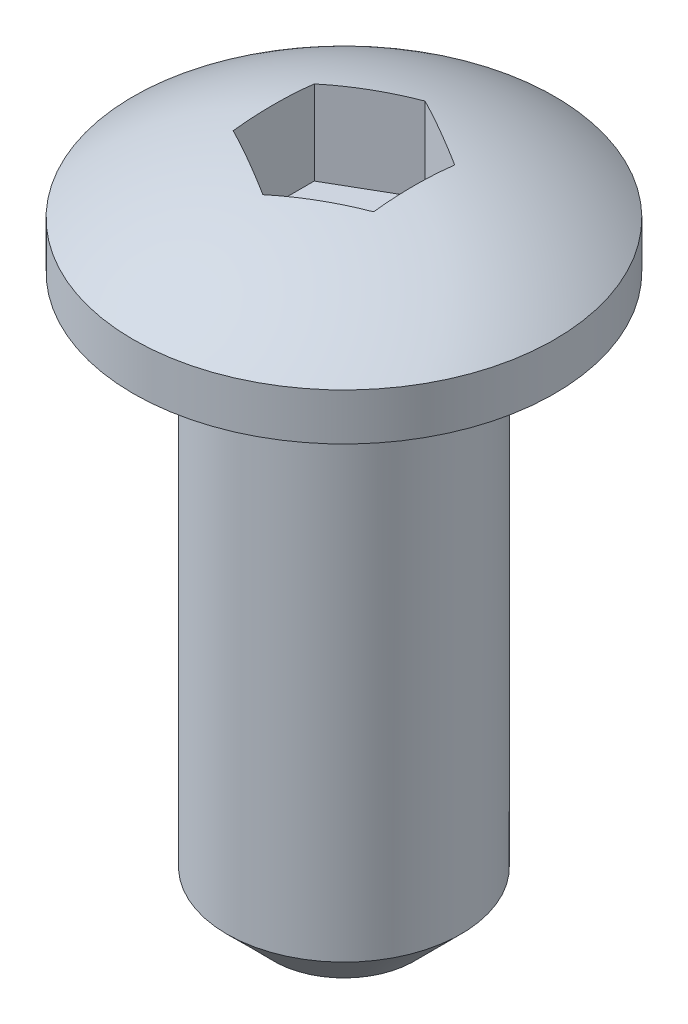
ISO-10303-21;
HEADER;
FILE_DESCRIPTION(('STEP AP214'),'2;1');
FILE_NAME('part.step','',(''),(''),'','','');
FILE_SCHEMA(('AUTOMOTIVE_DESIGN { 1 0 10303 214 1 1 1 1 }'));
ENDSEC;
DATA;
#1=APPLICATION_CONTEXT('core data for automotive mechanical design processes');
#2=APPLICATION_PROTOCOL_DEFINITION('international standard','automotive_design',2000,#1);
#3=PRODUCT_CONTEXT('',#1,'mechanical');
#4=PRODUCT('Part','Part','',(#3));
#5=PRODUCT_RELATED_PRODUCT_CATEGORY('part','',(#4));
#6=PRODUCT_DEFINITION_FORMATION('','',#4);
#7=PRODUCT_DEFINITION_CONTEXT('part definition',#1,'design');
#8=PRODUCT_DEFINITION('design','',#6,#7);
#9=PRODUCT_DEFINITION_SHAPE('','',#8);
#10=(LENGTH_UNIT() NAMED_UNIT(*) SI_UNIT(.MILLI.,.METRE.));
#11=(NAMED_UNIT(*) PLANE_ANGLE_UNIT() SI_UNIT($,.RADIAN.));
#12=(NAMED_UNIT(*) SI_UNIT($,.STERADIAN.) SOLID_ANGLE_UNIT());
#13=UNCERTAINTY_MEASURE_WITH_UNIT(LENGTH_MEASURE(1.E-05),#10,'distance_accuracy_value','');
#14=(GEOMETRIC_REPRESENTATION_CONTEXT(3) GLOBAL_UNCERTAINTY_ASSIGNED_CONTEXT((#13)) GLOBAL_UNIT_ASSIGNED_CONTEXT((#10,
#11,#12)) REPRESENTATION_CONTEXT('',''));
#15=CARTESIAN_POINT('',(0.,0.,0.));
#16=DIRECTION('',(0.,0.,1.));
#17=DIRECTION('',(1.,0.,0.));
#18=AXIS2_PLACEMENT_3D('',#15,#16,#17);
#19=CARTESIAN_POINT('',(0.,-5.,0.));
#20=DIRECTION('',(0.,1.,0.));
#21=DIRECTION('',(-1.,0.,0.));
#22=AXIS2_PLACEMENT_3D('',#19,#20,#21);
#23=SPHERICAL_SURFACE('',#22,7.5);
#24=CARTESIAN_POINT('',(0.,1.,0.));
#25=DIRECTION('',(0.,1.,0.));
#26=DIRECTION('',(0.,0.,1.));
#27=AXIS2_PLACEMENT_3D('',#24,#25,#26);
#28=CIRCLE('',#27,4.5);
#29=CARTESIAN_POINT('',(0.,1.,4.5));
#30=VERTEX_POINT('',#29);
#31=EDGE_CURVE('E123',#30,#30,#28,.T.);
#32=ORIENTED_EDGE('',*,*,#31,.T.);
#33=EDGE_LOOP('',(#32));
#34=FACE_BOUND('',#33,.T.);
#35=CARTESIAN_POINT('',(-0.749999999999999,-5.,-1.29903810567666));
#36=DIRECTION('',(0.5,0.,0.866025403784439));
#37=DIRECTION('',(0.866025403784439,0.,-0.5));
#38=AXIS2_PLACEMENT_3D('',#35,#36,#37);
#39=CIRCLE('',#38,7.34846922834954);
#40=CARTESIAN_POINT('',(-1.5,2.29725975966321,-0.866025403784439));
#41=VERTEX_POINT('',#40);
#42=CARTESIAN_POINT('',(0.,2.29725975966321,-1.73205080756888));
#43=VERTEX_POINT('',#42);
#44=EDGE_CURVE('E138',#41,#43,#39,.F.);
#45=ORIENTED_EDGE('',*,*,#44,.T.);
#46=CARTESIAN_POINT('',(0.750000000000002,-5.,-1.29903810567666));
#47=DIRECTION('',(-0.5,0.,0.866025403784438));
#48=DIRECTION('',(0.866025403784439,0.,0.5));
#49=AXIS2_PLACEMENT_3D('',#46,#47,#48);
#50=CIRCLE('',#49,7.34846922834954);
#51=CARTESIAN_POINT('',(1.5,2.29725975966321,-0.866025403784439));
#52=VERTEX_POINT('',#51);
#53=EDGE_CURVE('E49',#43,#52,#50,.F.);
#54=ORIENTED_EDGE('',*,*,#53,.T.);
#55=CARTESIAN_POINT('',(1.5,-5.,0.));
#56=DIRECTION('',(-1.,0.,0.));
#57=DIRECTION('',(0.,0.,1.));
#58=AXIS2_PLACEMENT_3D('',#55,#56,#57);
#59=CIRCLE('',#58,7.34846922834954);
#60=CARTESIAN_POINT('',(1.5,2.29725975966321,0.86602540378444));
#61=VERTEX_POINT('',#60);
#62=EDGE_CURVE('E126',#52,#61,#59,.F.);
#63=ORIENTED_EDGE('',*,*,#62,.T.);
#64=CARTESIAN_POINT('',(0.750000000000002,-5.,1.29903810567666));
#65=DIRECTION('',(-0.5,0.,-0.866025403784439));
#66=DIRECTION('',(-0.866025403784439,0.,0.5));
#67=AXIS2_PLACEMENT_3D('',#64,#65,#66);
#68=CIRCLE('',#67,7.34846922834954);
#69=CARTESIAN_POINT('',(0.,2.29725975966321,1.73205080756888));
#70=VERTEX_POINT('',#69);
#71=EDGE_CURVE('E129',#61,#70,#68,.F.);
#72=ORIENTED_EDGE('',*,*,#71,.T.);
#73=CARTESIAN_POINT('',(-0.749999999999998,-5.,1.29903810567666));
#74=DIRECTION('',(0.5,0.,-0.866025403784439));
#75=DIRECTION('',(-0.866025403784439,0.,-0.5));
#76=AXIS2_PLACEMENT_3D('',#73,#74,#75);
#77=CIRCLE('',#76,7.34846922834954);
#78=CARTESIAN_POINT('',(-1.5,2.29725975966321,0.866025403784438));
#79=VERTEX_POINT('',#78);
#80=EDGE_CURVE('E132',#70,#79,#77,.F.);
#81=ORIENTED_EDGE('',*,*,#80,.T.);
#82=CARTESIAN_POINT('',(-1.5,-5.,0.));
#83=DIRECTION('',(1.,0.,0.));
#84=DIRECTION('',(0.,0.,-1.));
#85=AXIS2_PLACEMENT_3D('',#82,#83,#84);
#86=CIRCLE('',#85,7.34846922834954);
#87=EDGE_CURVE('E135',#79,#41,#86,.F.);
#88=ORIENTED_EDGE('',*,*,#87,.T.);
#89=EDGE_LOOP('',(#45,#54,#63,#72,#81,#88));
#90=FACE_BOUND('',#89,.T.);
#91=ADVANCED_FACE('F26',(#34,#90),#23,.T.);
#92=CARTESIAN_POINT('',(0.,-12.,0.));
#93=DIRECTION('',(0.,-1.,0.));
#94=DIRECTION('',(0.,0.,-1.));
#95=AXIS2_PLACEMENT_3D('',#92,#93,#94);
#96=PLANE('',#95);
#97=CARTESIAN_POINT('',(0.,-12.,0.));
#98=DIRECTION('',(0.,-1.,0.));
#99=DIRECTION('',(0.,0.,-1.));
#100=AXIS2_PLACEMENT_3D('',#97,#98,#99);
#101=CIRCLE('',#100,1.49999999999999);
#102=CARTESIAN_POINT('',(0.,-12.,-1.49999999999999));
#103=VERTEX_POINT('',#102);
#104=EDGE_CURVE('E11',#103,#103,#101,.T.);
#105=ORIENTED_EDGE('',*,*,#104,.T.);
#106=EDGE_LOOP('',(#105));
#107=FACE_BOUND('',#106,.T.);
#108=ADVANCED_FACE('F28',(#107),#96,.T.);
#109=CARTESIAN_POINT('',(0.,16.1829805996473,0.));
#110=DIRECTION('',(0.,1.,0.));
#111=DIRECTION('',(0.,0.,1.));
#112=AXIS2_PLACEMENT_3D('',#109,#110,#111);
#113=CYLINDRICAL_SURFACE('',#112,4.5);
#114=CARTESIAN_POINT('',(0.,0.,0.));
#115=DIRECTION('',(0.,1.,0.));
#116=DIRECTION('',(0.,0.,1.));
#117=AXIS2_PLACEMENT_3D('',#114,#115,#116);
#118=CIRCLE('',#117,4.5);
#119=CARTESIAN_POINT('',(0.,0.,4.5));
#120=VERTEX_POINT('',#119);
#121=EDGE_CURVE('E120',#120,#120,#118,.T.);
#122=ORIENTED_EDGE('',*,*,#121,.T.);
#123=EDGE_LOOP('',(#122));
#124=FACE_BOUND('',#123,.T.);
#125=ORIENTED_EDGE('',*,*,#31,.F.);
#126=EDGE_LOOP('',(#125));
#127=FACE_BOUND('',#126,.T.);
#128=ADVANCED_FACE('F164',(#124,#127),#113,.T.);
#129=CARTESIAN_POINT('',(-2.5,0.,0.));
#130=DIRECTION('',(0.,-1.,0.));
#131=DIRECTION('',(0.,0.,-1.));
#132=AXIS2_PLACEMENT_3D('',#129,#130,#131);
#133=PLANE('',#132);
#134=CARTESIAN_POINT('',(0.,0.,0.));
#135=DIRECTION('',(0.,1.,0.));
#136=DIRECTION('',(0.,0.,1.));
#137=AXIS2_PLACEMENT_3D('',#134,#135,#136);
#138=CIRCLE('',#137,2.5);
#139=CARTESIAN_POINT('',(0.,0.,2.5));
#140=VERTEX_POINT('',#139);
#141=EDGE_CURVE('E85',#140,#140,#138,.T.);
#142=ORIENTED_EDGE('',*,*,#141,.T.);
#143=EDGE_LOOP('',(#142));
#144=FACE_BOUND('',#143,.T.);
#145=ORIENTED_EDGE('',*,*,#121,.F.);
#146=EDGE_LOOP('',(#145));
#147=FACE_BOUND('',#146,.T.);
#148=ADVANCED_FACE('F170',(#144,#147),#133,.T.);
#149=CARTESIAN_POINT('',(0.,16.1829805996473,0.));
#150=DIRECTION('',(0.,1.,0.));
#151=DIRECTION('',(0.,0.,1.));
#152=AXIS2_PLACEMENT_3D('',#149,#150,#151);
#153=CYLINDRICAL_SURFACE('',#152,2.5);
#154=CARTESIAN_POINT('',(0.,-11.,0.));
#155=DIRECTION('',(0.,-1.,0.));
#156=DIRECTION('',(0.,0.,-1.));
#157=AXIS2_PLACEMENT_3D('',#154,#155,#156);
#158=CIRCLE('',#157,2.5);
#159=CARTESIAN_POINT('',(0.,-11.,-2.5));
#160=VERTEX_POINT('',#159);
#161=EDGE_CURVE('E34',#160,#160,#158,.F.);
#162=ORIENTED_EDGE('',*,*,#161,.T.);
#163=EDGE_LOOP('',(#162));
#164=FACE_BOUND('',#163,.T.);
#165=ORIENTED_EDGE('',*,*,#141,.F.);
#166=EDGE_LOOP('',(#165));
#167=FACE_BOUND('',#166,.T.);
#168=ADVANCED_FACE('F143',(#164,#167),#153,.T.);
#169=CARTESIAN_POINT('',(1.5,2.5,-0.866025403784439));
#170=DIRECTION('',(-0.5,0.,0.866025403784438));
#171=DIRECTION('',(0.866025403784439,0.,0.5));
#172=AXIS2_PLACEMENT_3D('',#169,#170,#171);
#173=PLANE('',#172);
#174=DIRECTION('',(0.,-1.,0.));
#175=VECTOR('',#174,1.);
#176=CARTESIAN_POINT('',(0.,2.5,-1.73205080756888));
#177=LINE('',#176,#175);
#178=CARTESIAN_POINT('',(0.,0.5,-1.73205080756888));
#179=VERTEX_POINT('',#178);
#180=EDGE_CURVE('E78',#43,#179,#177,.T.);
#181=ORIENTED_EDGE('',*,*,#180,.T.);
#182=DIRECTION('',(-0.866025403784439,0.,-0.5));
#183=VECTOR('',#182,1.);
#184=CARTESIAN_POINT('',(1.5,0.5,-0.866025403784439));
#185=LINE('',#184,#183);
#186=CARTESIAN_POINT('',(1.5,0.5,-0.866025403784439));
#187=VERTEX_POINT('',#186);
#188=EDGE_CURVE('E82',#187,#179,#185,.T.);
#189=ORIENTED_EDGE('',*,*,#188,.F.);
#190=DIRECTION('',(0.,-1.,0.));
#191=VECTOR('',#190,1.);
#192=CARTESIAN_POINT('',(1.5,2.5,-0.866025403784439));
#193=LINE('',#192,#191);
#194=EDGE_CURVE('E110',#52,#187,#193,.T.);
#195=ORIENTED_EDGE('',*,*,#194,.F.);
#196=ORIENTED_EDGE('',*,*,#53,.F.);
#197=EDGE_LOOP('',(#181,#189,#195,#196));
#198=FACE_BOUND('',#197,.T.);
#199=ADVANCED_FACE('F80',(#198),#173,.T.);
#200=CARTESIAN_POINT('',(0.,2.5,-1.73205080756888));
#201=DIRECTION('',(0.5,0.,0.866025403784439));
#202=DIRECTION('',(0.866025403784439,0.,-0.5));
#203=AXIS2_PLACEMENT_3D('',#200,#201,#202);
#204=PLANE('',#203);
#205=DIRECTION('',(0.,-1.,0.));
#206=VECTOR('',#205,1.);
#207=CARTESIAN_POINT('',(-1.5,2.5,-0.866025403784439));
#208=LINE('',#207,#206);
#209=CARTESIAN_POINT('',(-1.5,0.5,-0.866025403784439));
#210=VERTEX_POINT('',#209);
#211=EDGE_CURVE('E86',#41,#210,#208,.T.);
#212=ORIENTED_EDGE('',*,*,#211,.T.);
#213=DIRECTION('',(-0.866025403784439,0.,0.5));
#214=VECTOR('',#213,1.);
#215=CARTESIAN_POINT('',(0.,0.5,-1.73205080756888));
#216=LINE('',#215,#214);
#217=EDGE_CURVE('E89',#179,#210,#216,.T.);
#218=ORIENTED_EDGE('',*,*,#217,.F.);
#219=ORIENTED_EDGE('',*,*,#180,.F.);
#220=ORIENTED_EDGE('',*,*,#44,.F.);
#221=EDGE_LOOP('',(#212,#218,#219,#220));
#222=FACE_BOUND('',#221,.T.);
#223=ADVANCED_FACE('F90',(#222),#204,.T.);
#224=CARTESIAN_POINT('',(-1.5,2.5,-0.866025403784439));
#225=DIRECTION('',(1.,0.,0.));
#226=DIRECTION('',(0.,0.,-1.));
#227=AXIS2_PLACEMENT_3D('',#224,#225,#226);
#228=PLANE('',#227);
#229=DIRECTION('',(0.,-1.,0.));
#230=VECTOR('',#229,1.);
#231=CARTESIAN_POINT('',(-1.5,2.5,0.866025403784438));
#232=LINE('',#231,#230);
#233=CARTESIAN_POINT('',(-1.5,0.5,0.866025403784438));
#234=VERTEX_POINT('',#233);
#235=EDGE_CURVE('E115',#79,#234,#232,.T.);
#236=ORIENTED_EDGE('',*,*,#235,.T.);
#237=DIRECTION('',(0.,0.,1.));
#238=VECTOR('',#237,1.);
#239=CARTESIAN_POINT('',(-1.5,0.5,-0.866025403784439));
#240=LINE('',#239,#238);
#241=EDGE_CURVE('E95',#210,#234,#240,.T.);
#242=ORIENTED_EDGE('',*,*,#241,.F.);
#243=ORIENTED_EDGE('',*,*,#211,.F.);
#244=ORIENTED_EDGE('',*,*,#87,.F.);
#245=EDGE_LOOP('',(#236,#242,#243,#244));
#246=FACE_BOUND('',#245,.T.);
#247=ADVANCED_FACE('F178',(#246),#228,.T.);
#248=CARTESIAN_POINT('',(-1.5,2.5,0.866025403784438));
#249=DIRECTION('',(0.5,0.,-0.866025403784439));
#250=DIRECTION('',(-0.866025403784439,0.,-0.5));
#251=AXIS2_PLACEMENT_3D('',#248,#249,#250);
#252=PLANE('',#251);
#253=DIRECTION('',(0.,-1.,0.));
#254=VECTOR('',#253,1.);
#255=CARTESIAN_POINT('',(0.,2.5,1.73205080756888));
#256=LINE('',#255,#254);
#257=CARTESIAN_POINT('',(0.,0.5,1.73205080756888));
#258=VERTEX_POINT('',#257);
#259=EDGE_CURVE('E113',#70,#258,#256,.T.);
#260=ORIENTED_EDGE('',*,*,#259,.T.);
#261=DIRECTION('',(0.866025403784439,0.,0.5));
#262=VECTOR('',#261,1.);
#263=CARTESIAN_POINT('',(-1.5,0.5,0.866025403784438));
#264=LINE('',#263,#262);
#265=EDGE_CURVE('E104',#234,#258,#264,.T.);
#266=ORIENTED_EDGE('',*,*,#265,.F.);
#267=ORIENTED_EDGE('',*,*,#235,.F.);
#268=ORIENTED_EDGE('',*,*,#80,.F.);
#269=EDGE_LOOP('',(#260,#266,#267,#268));
#270=FACE_BOUND('',#269,.T.);
#271=ADVANCED_FACE('F181',(#270),#252,.T.);
#272=CARTESIAN_POINT('',(0.,2.5,1.73205080756888));
#273=DIRECTION('',(-0.5,0.,-0.866025403784439));
#274=DIRECTION('',(-0.866025403784439,0.,0.5));
#275=AXIS2_PLACEMENT_3D('',#272,#273,#274);
#276=PLANE('',#275);
#277=DIRECTION('',(0.,-1.,0.));
#278=VECTOR('',#277,1.);
#279=CARTESIAN_POINT('',(1.5,2.5,0.86602540378444));
#280=LINE('',#279,#278);
#281=CARTESIAN_POINT('',(1.5,0.5,0.86602540378444));
#282=VERTEX_POINT('',#281);
#283=EDGE_CURVE('E41',#61,#282,#280,.T.);
#284=ORIENTED_EDGE('',*,*,#283,.T.);
#285=DIRECTION('',(0.866025403784439,0.,-0.5));
#286=VECTOR('',#285,1.);
#287=CARTESIAN_POINT('',(0.,0.5,1.73205080756888));
#288=LINE('',#287,#286);
#289=EDGE_CURVE('E107',#258,#282,#288,.T.);
#290=ORIENTED_EDGE('',*,*,#289,.F.);
#291=ORIENTED_EDGE('',*,*,#259,.F.);
#292=ORIENTED_EDGE('',*,*,#71,.F.);
#293=EDGE_LOOP('',(#284,#290,#291,#292));
#294=FACE_BOUND('',#293,.T.);
#295=ADVANCED_FACE('F185',(#294),#276,.T.);
#296=CARTESIAN_POINT('',(1.5,2.5,0.86602540378444));
#297=DIRECTION('',(-1.,0.,0.));
#298=DIRECTION('',(0.,0.,1.));
#299=AXIS2_PLACEMENT_3D('',#296,#297,#298);
#300=PLANE('',#299);
#301=ORIENTED_EDGE('',*,*,#194,.T.);
#302=DIRECTION('',(0.,0.,-1.));
#303=VECTOR('',#302,1.);
#304=CARTESIAN_POINT('',(1.5,0.5,0.86602540378444));
#305=LINE('',#304,#303);
#306=EDGE_CURVE('E100',#282,#187,#305,.T.);
#307=ORIENTED_EDGE('',*,*,#306,.F.);
#308=ORIENTED_EDGE('',*,*,#283,.F.);
#309=ORIENTED_EDGE('',*,*,#62,.F.);
#310=EDGE_LOOP('',(#301,#307,#308,#309));
#311=FACE_BOUND('',#310,.T.);
#312=ADVANCED_FACE('F154',(#311),#300,.T.);
#313=CARTESIAN_POINT('',(3.,0.5,0.));
#314=DIRECTION('',(0.,-1.,0.));
#315=DIRECTION('',(0.,0.,-1.));
#316=AXIS2_PLACEMENT_3D('',#313,#314,#315);
#317=PLANE('',#316);
#318=ORIENTED_EDGE('',*,*,#188,.T.);
#319=ORIENTED_EDGE('',*,*,#217,.T.);
#320=ORIENTED_EDGE('',*,*,#241,.T.);
#321=ORIENTED_EDGE('',*,*,#265,.T.);
#322=ORIENTED_EDGE('',*,*,#289,.T.);
#323=ORIENTED_EDGE('',*,*,#306,.T.);
#324=EDGE_LOOP('',(#318,#319,#320,#321,#322,#323));
#325=FACE_BOUND('',#324,.T.);
#326=ADVANCED_FACE('F98',(#325),#317,.F.);
#327=CARTESIAN_POINT('',(0.,-11.,0.));
#328=DIRECTION('',(0.,1.,0.));
#329=DIRECTION('',(0.,0.,1.));
#330=AXIS2_PLACEMENT_3D('',#327,#328,#329);
#331=CONICAL_SURFACE('',#330,2.5,0.785398163397451);
#332=ORIENTED_EDGE('',*,*,#104,.F.);
#333=EDGE_LOOP('',(#332));
#334=FACE_BOUND('',#333,.T.);
#335=ORIENTED_EDGE('',*,*,#161,.F.);
#336=EDGE_LOOP('',(#335));
#337=FACE_BOUND('',#336,.T.);
#338=ADVANCED_FACE('F146',(#334,#337),#331,.T.);
#339=CLOSED_SHELL('',(#91,#108,#128,#148,#168,#199,#223,#247,#271,#295,#312,#326,#338));
#340=MANIFOLD_SOLID_BREP('B2',#339);
#341=ADVANCED_BREP_SHAPE_REPRESENTATION('',(#18,#340),#14);
#342=SHAPE_DEFINITION_REPRESENTATION(#9,#341);
ENDSEC;
END-ISO-10303-21;
